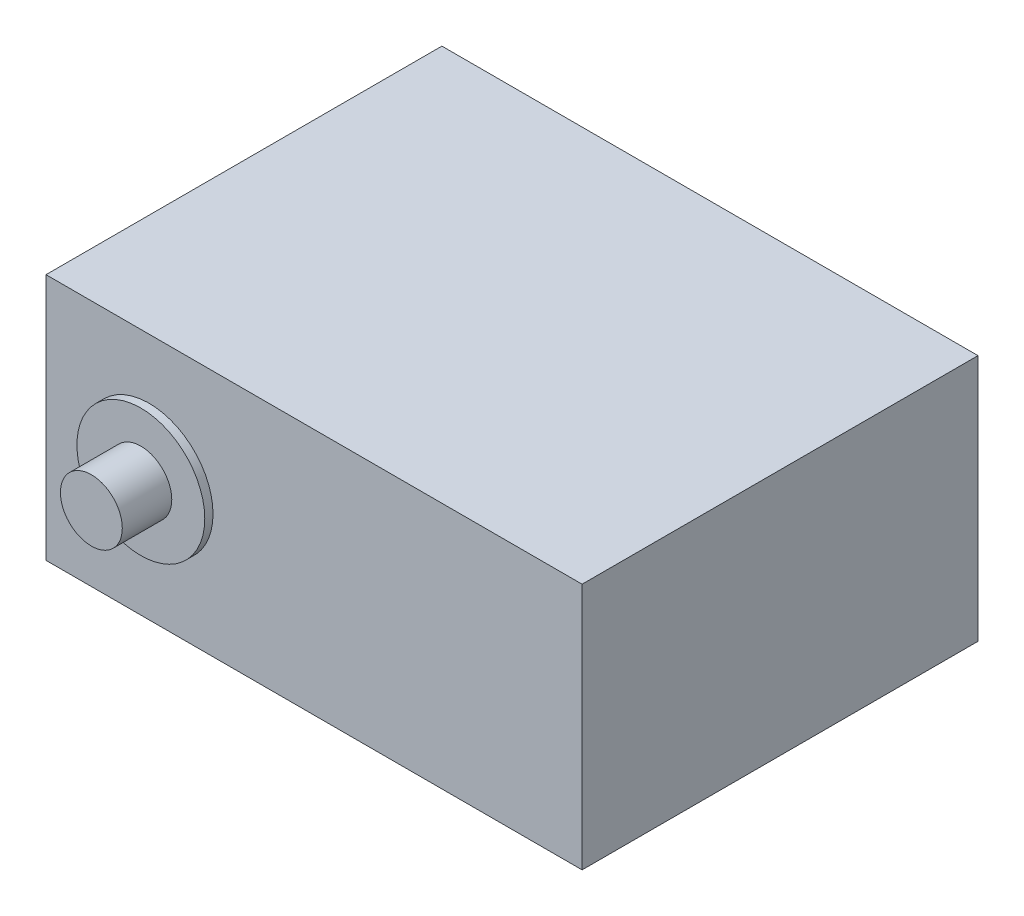
ISO-10303-21;
HEADER;
FILE_DESCRIPTION(('STEP AP214'),'2;1');
FILE_NAME('part.step','',(''),(''),'','','');
FILE_SCHEMA(('AUTOMOTIVE_DESIGN { 1 0 10303 214 1 1 1 1 }'));
ENDSEC;
DATA;
#1=APPLICATION_CONTEXT('core data for automotive mechanical design processes');
#2=APPLICATION_PROTOCOL_DEFINITION('international standard','automotive_design',2000,#1);
#3=PRODUCT_CONTEXT('',#1,'mechanical');
#4=PRODUCT('Part','Part','',(#3));
#5=PRODUCT_RELATED_PRODUCT_CATEGORY('part','',(#4));
#6=PRODUCT_DEFINITION_FORMATION('','',#4);
#7=PRODUCT_DEFINITION_CONTEXT('part definition',#1,'design');
#8=PRODUCT_DEFINITION('design','',#6,#7);
#9=PRODUCT_DEFINITION_SHAPE('','',#8);
#10=(LENGTH_UNIT() NAMED_UNIT(*) SI_UNIT(.MILLI.,.METRE.));
#11=(NAMED_UNIT(*) PLANE_ANGLE_UNIT() SI_UNIT($,.RADIAN.));
#12=(NAMED_UNIT(*) SI_UNIT($,.STERADIAN.) SOLID_ANGLE_UNIT());
#13=UNCERTAINTY_MEASURE_WITH_UNIT(LENGTH_MEASURE(1.E-05),#10,'distance_accuracy_value','');
#14=(GEOMETRIC_REPRESENTATION_CONTEXT(3) GLOBAL_UNCERTAINTY_ASSIGNED_CONTEXT((#13)) GLOBAL_UNIT_ASSIGNED_CONTEXT((#10,
#11,#12)) REPRESENTATION_CONTEXT('',''));
#15=CARTESIAN_POINT('',(0.,0.,0.));
#16=DIRECTION('',(0.,0.,1.));
#17=DIRECTION('',(1.,0.,0.));
#18=AXIS2_PLACEMENT_3D('',#15,#16,#17);
#19=CARTESIAN_POINT('',(-24.1428571428572,16.3571428571429,48.));
#20=DIRECTION('',(1.,0.,0.));
#21=DIRECTION('',(0.,0.,-1.));
#22=AXIS2_PLACEMENT_3D('',#19,#20,#21);
#23=PLANE('',#22);
#24=DIRECTION('',(0.,-1.,0.));
#25=VECTOR('',#24,1.);
#26=CARTESIAN_POINT('',(-24.1428571428572,16.3571428571429,0.));
#27=LINE('',#26,#25);
#28=CARTESIAN_POINT('',(-24.1428571428572,16.3571428571429,0.));
#29=VERTEX_POINT('',#28);
#30=CARTESIAN_POINT('',(-24.1428571428572,-13.6428571428571,0.));
#31=VERTEX_POINT('',#30);
#32=EDGE_CURVE('E180',#29,#31,#27,.T.);
#33=ORIENTED_EDGE('',*,*,#32,.T.);
#34=DIRECTION('',(0.,0.,-1.));
#35=VECTOR('',#34,1.);
#36=CARTESIAN_POINT('',(-24.1428571428572,-13.6428571428571,48.));
#37=LINE('',#36,#35);
#38=CARTESIAN_POINT('',(-24.1428571428572,-13.6428571428571,48.));
#39=VERTEX_POINT('',#38);
#40=EDGE_CURVE('E195',#39,#31,#37,.T.);
#41=ORIENTED_EDGE('',*,*,#40,.F.);
#42=DIRECTION('',(0.,-1.,0.));
#43=VECTOR('',#42,1.);
#44=CARTESIAN_POINT('',(-24.1428571428572,16.3571428571429,48.));
#45=LINE('',#44,#43);
#46=CARTESIAN_POINT('',(-24.1428571428572,16.3571428571429,48.));
#47=VERTEX_POINT('',#46);
#48=EDGE_CURVE('E166',#47,#39,#45,.T.);
#49=ORIENTED_EDGE('',*,*,#48,.F.);
#50=DIRECTION('',(0.,0.,-1.));
#51=VECTOR('',#50,1.);
#52=CARTESIAN_POINT('',(-24.1428571428572,16.3571428571429,48.));
#53=LINE('',#52,#51);
#54=EDGE_CURVE('E52',#47,#29,#53,.T.);
#55=ORIENTED_EDGE('',*,*,#54,.T.);
#56=EDGE_LOOP('',(#33,#41,#49,#55));
#57=FACE_BOUND('',#56,.T.);
#58=DIRECTION('',(0.,1.,0.));
#59=VECTOR('',#58,1.);
#60=CARTESIAN_POINT('',(-24.1428571428572,4.35714285714286,10.5));
#61=LINE('',#60,#59);
#62=CARTESIAN_POINT('',(-24.1428571428572,-1.64285714285714,10.5));
#63=VERTEX_POINT('',#62);
#64=CARTESIAN_POINT('',(-24.1428571428572,4.35714285714286,10.5));
#65=VERTEX_POINT('',#64);
#66=EDGE_CURVE('E131',#63,#65,#61,.T.);
#67=ORIENTED_EDGE('',*,*,#66,.F.);
#68=DIRECTION('',(0.,0.,1.));
#69=VECTOR('',#68,1.);
#70=CARTESIAN_POINT('',(-24.1428571428572,-1.64285714285714,6.5));
#71=LINE('',#70,#69);
#72=CARTESIAN_POINT('',(-24.1428571428572,-1.64285714285714,6.5));
#73=VERTEX_POINT('',#72);
#74=EDGE_CURVE('E128',#73,#63,#71,.T.);
#75=ORIENTED_EDGE('',*,*,#74,.F.);
#76=DIRECTION('',(0.,-1.,0.));
#77=VECTOR('',#76,1.);
#78=CARTESIAN_POINT('',(-24.1428571428572,4.35714285714286,6.5));
#79=LINE('',#78,#77);
#80=CARTESIAN_POINT('',(-24.1428571428572,4.35714285714286,6.5));
#81=VERTEX_POINT('',#80);
#82=EDGE_CURVE('E64',#81,#73,#79,.T.);
#83=ORIENTED_EDGE('',*,*,#82,.F.);
#84=DIRECTION('',(0.,0.,-1.));
#85=VECTOR('',#84,1.);
#86=CARTESIAN_POINT('',(-24.1428571428572,4.35714285714286,6.5));
#87=LINE('',#86,#85);
#88=EDGE_CURVE('E59',#65,#81,#87,.T.);
#89=ORIENTED_EDGE('',*,*,#88,.F.);
#90=EDGE_LOOP('',(#67,#75,#83,#89));
#91=FACE_BOUND('',#90,.T.);
#92=ADVANCED_FACE('F43',(#57,#91),#23,.F.);
#93=CARTESIAN_POINT('',(-24.1428571428572,16.3571428571429,48.));
#94=DIRECTION('',(0.,-1.,0.));
#95=DIRECTION('',(0.,0.,-1.));
#96=AXIS2_PLACEMENT_3D('',#93,#94,#95);
#97=PLANE('',#96);
#98=DIRECTION('',(-1.,0.,0.));
#99=VECTOR('',#98,1.);
#100=CARTESIAN_POINT('',(-24.1428571428572,16.3571428571429,0.));
#101=LINE('',#100,#99);
#102=CARTESIAN_POINT('',(40.8571428571428,16.3571428571429,0.));
#103=VERTEX_POINT('',#102);
#104=EDGE_CURVE('E161',#103,#29,#101,.T.);
#105=ORIENTED_EDGE('',*,*,#104,.T.);
#106=ORIENTED_EDGE('',*,*,#54,.F.);
#107=DIRECTION('',(-1.,0.,0.));
#108=VECTOR('',#107,1.);
#109=CARTESIAN_POINT('',(-24.1428571428572,16.3571428571429,48.));
#110=LINE('',#109,#108);
#111=CARTESIAN_POINT('',(40.8571428571428,16.3571428571429,48.));
#112=VERTEX_POINT('',#111);
#113=EDGE_CURVE('E162',#112,#47,#110,.T.);
#114=ORIENTED_EDGE('',*,*,#113,.F.);
#115=DIRECTION('',(0.,0.,-1.));
#116=VECTOR('',#115,1.);
#117=CARTESIAN_POINT('',(40.8571428571428,16.3571428571429,48.));
#118=LINE('',#117,#116);
#119=EDGE_CURVE('E176',#112,#103,#118,.T.);
#120=ORIENTED_EDGE('',*,*,#119,.T.);
#121=EDGE_LOOP('',(#105,#106,#114,#120));
#122=FACE_BOUND('',#121,.T.);
#123=ADVANCED_FACE('F45',(#122),#97,.F.);
#124=CARTESIAN_POINT('',(-24.1428571428572,-13.6428571428571,48.));
#125=DIRECTION('',(0.,1.,0.));
#126=DIRECTION('',(0.,0.,1.));
#127=AXIS2_PLACEMENT_3D('',#124,#125,#126);
#128=PLANE('',#127);
#129=DIRECTION('',(1.,0.,0.));
#130=VECTOR('',#129,1.);
#131=CARTESIAN_POINT('',(-24.1428571428572,-13.6428571428571,0.));
#132=LINE('',#131,#130);
#133=CARTESIAN_POINT('',(40.8571428571428,-13.6428571428571,0.));
#134=VERTEX_POINT('',#133);
#135=EDGE_CURVE('E183',#31,#134,#132,.T.);
#136=ORIENTED_EDGE('',*,*,#135,.T.);
#137=DIRECTION('',(0.,0.,-1.));
#138=VECTOR('',#137,1.);
#139=CARTESIAN_POINT('',(40.8571428571428,-13.6428571428571,48.));
#140=LINE('',#139,#138);
#141=CARTESIAN_POINT('',(40.8571428571428,-13.6428571428571,48.));
#142=VERTEX_POINT('',#141);
#143=EDGE_CURVE('E191',#142,#134,#140,.T.);
#144=ORIENTED_EDGE('',*,*,#143,.F.);
#145=DIRECTION('',(1.,0.,0.));
#146=VECTOR('',#145,1.);
#147=CARTESIAN_POINT('',(-24.1428571428572,-13.6428571428571,48.));
#148=LINE('',#147,#146);
#149=EDGE_CURVE('E170',#39,#142,#148,.T.);
#150=ORIENTED_EDGE('',*,*,#149,.F.);
#151=ORIENTED_EDGE('',*,*,#40,.T.);
#152=EDGE_LOOP('',(#136,#144,#150,#151));
#153=FACE_BOUND('',#152,.T.);
#154=ADVANCED_FACE('F244',(#153),#128,.F.);
#155=CARTESIAN_POINT('',(40.8571428571428,-13.6428571428571,48.));
#156=DIRECTION('',(-1.,0.,0.));
#157=DIRECTION('',(0.,0.,1.));
#158=AXIS2_PLACEMENT_3D('',#155,#156,#157);
#159=PLANE('',#158);
#160=DIRECTION('',(0.,1.,0.));
#161=VECTOR('',#160,1.);
#162=CARTESIAN_POINT('',(40.8571428571428,-13.6428571428571,0.));
#163=LINE('',#162,#161);
#164=EDGE_CURVE('E167',#134,#103,#163,.T.);
#165=ORIENTED_EDGE('',*,*,#164,.T.);
#166=ORIENTED_EDGE('',*,*,#119,.F.);
#167=DIRECTION('',(0.,1.,0.));
#168=VECTOR('',#167,1.);
#169=CARTESIAN_POINT('',(40.8571428571428,-13.6428571428571,48.));
#170=LINE('',#169,#168);
#171=EDGE_CURVE('E173',#142,#112,#170,.T.);
#172=ORIENTED_EDGE('',*,*,#171,.F.);
#173=ORIENTED_EDGE('',*,*,#143,.T.);
#174=EDGE_LOOP('',(#165,#166,#172,#173));
#175=FACE_BOUND('',#174,.T.);
#176=ADVANCED_FACE('F240',(#175),#159,.F.);
#177=CARTESIAN_POINT('',(0.,0.,48.));
#178=DIRECTION('',(0.,0.,1.));
#179=DIRECTION('',(1.,0.,0.));
#180=AXIS2_PLACEMENT_3D('',#177,#178,#179);
#181=PLANE('',#180);
#182=CARTESIAN_POINT('',(-11.6428571428572,1.35714285714286,48.));
#183=DIRECTION('',(0.,0.,1.));
#184=DIRECTION('',(1.,0.,0.));
#185=AXIS2_PLACEMENT_3D('',#182,#183,#184);
#186=CIRCLE('',#185,7.75);
#187=CARTESIAN_POINT('',(-3.89285714285716,1.35714285714286,48.));
#188=VERTEX_POINT('',#187);
#189=EDGE_CURVE('E148',#188,#188,#186,.T.);
#190=ORIENTED_EDGE('',*,*,#189,.F.);
#191=EDGE_LOOP('',(#190));
#192=FACE_BOUND('',#191,.T.);
#193=ORIENTED_EDGE('',*,*,#113,.T.);
#194=ORIENTED_EDGE('',*,*,#48,.T.);
#195=ORIENTED_EDGE('',*,*,#149,.T.);
#196=ORIENTED_EDGE('',*,*,#171,.T.);
#197=EDGE_LOOP('',(#193,#194,#195,#196));
#198=FACE_BOUND('',#197,.T.);
#199=ADVANCED_FACE('F229',(#192,#198),#181,.T.);
#200=CARTESIAN_POINT('',(0.,0.,0.));
#201=DIRECTION('',(0.,0.,1.));
#202=DIRECTION('',(1.,0.,0.));
#203=AXIS2_PLACEMENT_3D('',#200,#201,#202);
#204=PLANE('',#203);
#205=CARTESIAN_POINT('',(-11.6428571428572,1.35714285714286,0.));
#206=DIRECTION('',(0.,0.,1.));
#207=DIRECTION('',(1.,0.,0.));
#208=AXIS2_PLACEMENT_3D('',#205,#206,#207);
#209=CIRCLE('',#208,7.75);
#210=CARTESIAN_POINT('',(-3.89285714285715,1.35714285714286,0.));
#211=VERTEX_POINT('',#210);
#212=EDGE_CURVE('E11',#211,#211,#209,.F.);
#213=ORIENTED_EDGE('',*,*,#212,.F.);
#214=EDGE_LOOP('',(#213));
#215=FACE_BOUND('',#214,.T.);
#216=ORIENTED_EDGE('',*,*,#104,.F.);
#217=ORIENTED_EDGE('',*,*,#164,.F.);
#218=ORIENTED_EDGE('',*,*,#135,.F.);
#219=ORIENTED_EDGE('',*,*,#32,.F.);
#220=EDGE_LOOP('',(#216,#217,#218,#219));
#221=FACE_BOUND('',#220,.T.);
#222=ADVANCED_FACE('F225',(#215,#221),#204,.F.);
#223=CARTESIAN_POINT('',(-11.6428571428572,1.35714285714286,49.));
#224=DIRECTION('',(0.,0.,-1.));
#225=DIRECTION('',(-1.,0.,0.));
#226=AXIS2_PLACEMENT_3D('',#223,#224,#225);
#227=CYLINDRICAL_SURFACE('',#226,7.75);
#228=CARTESIAN_POINT('',(-11.6428571428572,1.35714285714286,49.));
#229=DIRECTION('',(0.,0.,1.));
#230=DIRECTION('',(1.,0.,0.));
#231=AXIS2_PLACEMENT_3D('',#228,#229,#230);
#232=CIRCLE('',#231,7.75);
#233=CARTESIAN_POINT('',(-3.89285714285716,1.35714285714286,49.));
#234=VERTEX_POINT('',#233);
#235=EDGE_CURVE('E149',#234,#234,#232,.T.);
#236=ORIENTED_EDGE('',*,*,#235,.F.);
#237=EDGE_LOOP('',(#236));
#238=FACE_BOUND('',#237,.T.);
#239=ORIENTED_EDGE('',*,*,#189,.T.);
#240=EDGE_LOOP('',(#239));
#241=FACE_BOUND('',#240,.T.);
#242=ADVANCED_FACE('F228',(#238,#241),#227,.T.);
#243=CARTESIAN_POINT('',(-11.6428571428572,1.35714285714286,49.));
#244=DIRECTION('',(0.,0.,1.));
#245=DIRECTION('',(1.,0.,0.));
#246=AXIS2_PLACEMENT_3D('',#243,#244,#245);
#247=PLANE('',#246);
#248=CARTESIAN_POINT('',(-11.6428571428572,1.35714285714286,49.));
#249=DIRECTION('',(0.,0.,1.));
#250=DIRECTION('',(1.,0.,0.));
#251=AXIS2_PLACEMENT_3D('',#248,#249,#250);
#252=CIRCLE('',#251,3.75);
#253=CARTESIAN_POINT('',(-7.89285714285716,1.35714285714286,49.));
#254=VERTEX_POINT('',#253);
#255=EDGE_CURVE('E153',#254,#254,#252,.T.);
#256=ORIENTED_EDGE('',*,*,#255,.F.);
#257=EDGE_LOOP('',(#256));
#258=FACE_BOUND('',#257,.T.);
#259=ORIENTED_EDGE('',*,*,#235,.T.);
#260=EDGE_LOOP('',(#259));
#261=FACE_BOUND('',#260,.T.);
#262=ADVANCED_FACE('F282',(#258,#261),#247,.T.);
#263=CARTESIAN_POINT('',(-11.6428571428572,1.35714285714286,55.));
#264=DIRECTION('',(0.,0.,1.));
#265=DIRECTION('',(1.,0.,0.));
#266=AXIS2_PLACEMENT_3D('',#263,#264,#265);
#267=PLANE('',#266);
#268=CARTESIAN_POINT('',(-11.6428571428572,1.35714285714286,55.));
#269=DIRECTION('',(0.,0.,1.));
#270=DIRECTION('',(1.,0.,0.));
#271=AXIS2_PLACEMENT_3D('',#268,#269,#270);
#272=CIRCLE('',#271,3.75);
#273=CARTESIAN_POINT('',(-7.89285714285716,1.35714285714286,55.));
#274=VERTEX_POINT('',#273);
#275=EDGE_CURVE('E157',#274,#274,#272,.T.);
#276=ORIENTED_EDGE('',*,*,#275,.T.);
#277=EDGE_LOOP('',(#276));
#278=FACE_BOUND('',#277,.T.);
#279=ADVANCED_FACE('F278',(#278),#267,.T.);
#280=CARTESIAN_POINT('',(-11.6428571428572,1.35714285714286,55.));
#281=DIRECTION('',(0.,0.,-1.));
#282=DIRECTION('',(-1.,0.,0.));
#283=AXIS2_PLACEMENT_3D('',#280,#281,#282);
#284=CYLINDRICAL_SURFACE('',#283,3.75);
#285=ORIENTED_EDGE('',*,*,#255,.T.);
#286=EDGE_LOOP('',(#285));
#287=FACE_BOUND('',#286,.T.);
#288=ORIENTED_EDGE('',*,*,#275,.F.);
#289=EDGE_LOOP('',(#288));
#290=FACE_BOUND('',#289,.T.);
#291=ADVANCED_FACE('F221',(#287,#290),#284,.T.);
#292=CARTESIAN_POINT('',(-11.6428571428572,1.35714285714286,-1.));
#293=DIRECTION('',(0.,0.,1.));
#294=DIRECTION('',(1.,0.,0.));
#295=AXIS2_PLACEMENT_3D('',#292,#293,#294);
#296=CYLINDRICAL_SURFACE('',#295,7.75);
#297=CARTESIAN_POINT('',(-11.6428571428572,1.35714285714286,-1.));
#298=DIRECTION('',(0.,0.,-1.));
#299=DIRECTION('',(-1.,0.,0.));
#300=AXIS2_PLACEMENT_3D('',#297,#298,#299);
#301=CIRCLE('',#300,7.75);
#302=CARTESIAN_POINT('',(-19.3928571428572,1.35714285714286,-1.));
#303=VERTEX_POINT('',#302);
#304=EDGE_CURVE('E133',#303,#303,#301,.T.);
#305=ORIENTED_EDGE('',*,*,#304,.F.);
#306=EDGE_LOOP('',(#305));
#307=FACE_BOUND('',#306,.T.);
#308=ORIENTED_EDGE('',*,*,#212,.T.);
#309=EDGE_LOOP('',(#308));
#310=FACE_BOUND('',#309,.T.);
#311=ADVANCED_FACE('F215',(#307,#310),#296,.T.);
#312=CARTESIAN_POINT('',(-11.6428571428572,1.35714285714286,-1.));
#313=DIRECTION('',(0.,0.,-1.));
#314=DIRECTION('',(-1.,0.,0.));
#315=AXIS2_PLACEMENT_3D('',#312,#313,#314);
#316=PLANE('',#315);
#317=CARTESIAN_POINT('',(-11.6428571428572,1.35714285714286,-1.));
#318=DIRECTION('',(0.,0.,-1.));
#319=DIRECTION('',(-1.,0.,0.));
#320=AXIS2_PLACEMENT_3D('',#317,#318,#319);
#321=CIRCLE('',#320,3.);
#322=CARTESIAN_POINT('',(-14.6428571428571,1.35714285714286,-1.));
#323=VERTEX_POINT('',#322);
#324=EDGE_CURVE('E138',#323,#323,#321,.T.);
#325=ORIENTED_EDGE('',*,*,#324,.F.);
#326=EDGE_LOOP('',(#325));
#327=FACE_BOUND('',#326,.T.);
#328=ORIENTED_EDGE('',*,*,#304,.T.);
#329=EDGE_LOOP('',(#328));
#330=FACE_BOUND('',#329,.T.);
#331=ADVANCED_FACE('F211',(#327,#330),#316,.T.);
#332=CARTESIAN_POINT('',(-11.6428571428572,1.35714285714286,-7.));
#333=DIRECTION('',(0.,0.,-1.));
#334=DIRECTION('',(-1.,0.,0.));
#335=AXIS2_PLACEMENT_3D('',#332,#333,#334);
#336=PLANE('',#335);
#337=CARTESIAN_POINT('',(-11.6428571428572,1.35714285714286,-7.));
#338=DIRECTION('',(0.,0.,-1.));
#339=DIRECTION('',(-1.,0.,0.));
#340=AXIS2_PLACEMENT_3D('',#337,#338,#339);
#341=CIRCLE('',#340,3.);
#342=CARTESIAN_POINT('',(-14.6428571428571,1.35714285714286,-7.));
#343=VERTEX_POINT('',#342);
#344=EDGE_CURVE('E144',#343,#343,#341,.T.);
#345=ORIENTED_EDGE('',*,*,#344,.T.);
#346=EDGE_LOOP('',(#345));
#347=FACE_BOUND('',#346,.T.);
#348=ADVANCED_FACE('F214',(#347),#336,.T.);
#349=CARTESIAN_POINT('',(-11.6428571428572,1.35714285714286,-7.));
#350=DIRECTION('',(0.,0.,1.));
#351=DIRECTION('',(1.,0.,0.));
#352=AXIS2_PLACEMENT_3D('',#349,#350,#351);
#353=CYLINDRICAL_SURFACE('',#352,3.);
#354=ORIENTED_EDGE('',*,*,#324,.T.);
#355=EDGE_LOOP('',(#354));
#356=FACE_BOUND('',#355,.T.);
#357=ORIENTED_EDGE('',*,*,#344,.F.);
#358=EDGE_LOOP('',(#357));
#359=FACE_BOUND('',#358,.T.);
#360=ADVANCED_FACE('F208',(#356,#359),#353,.T.);
#361=CARTESIAN_POINT('',(-29.6428571428572,4.35714285714286,10.5));
#362=DIRECTION('',(0.,0.,-1.));
#363=DIRECTION('',(0.,1.,0.));
#364=AXIS2_PLACEMENT_3D('',#361,#362,#363);
#365=PLANE('',#364);
#366=ORIENTED_EDGE('',*,*,#66,.T.);
#367=DIRECTION('',(1.,0.,0.));
#368=VECTOR('',#367,1.);
#369=CARTESIAN_POINT('',(-29.6428571428572,4.35714285714286,10.5));
#370=LINE('',#369,#368);
#371=CARTESIAN_POINT('',(-29.6428571428572,4.35714285714286,10.5));
#372=VERTEX_POINT('',#371);
#373=EDGE_CURVE('E110',#372,#65,#370,.T.);
#374=ORIENTED_EDGE('',*,*,#373,.F.);
#375=DIRECTION('',(0.,1.,0.));
#376=VECTOR('',#375,1.);
#377=CARTESIAN_POINT('',(-29.6428571428572,4.35714285714286,10.5));
#378=LINE('',#377,#376);
#379=CARTESIAN_POINT('',(-29.6428571428572,-1.64285714285714,10.5));
#380=VERTEX_POINT('',#379);
#381=EDGE_CURVE('E118',#380,#372,#378,.T.);
#382=ORIENTED_EDGE('',*,*,#381,.F.);
#383=DIRECTION('',(1.,0.,0.));
#384=VECTOR('',#383,1.);
#385=CARTESIAN_POINT('',(-29.6428571428572,-1.64285714285714,10.5));
#386=LINE('',#385,#384);
#387=EDGE_CURVE('E422',#380,#63,#386,.T.);
#388=ORIENTED_EDGE('',*,*,#387,.T.);
#389=EDGE_LOOP('',(#366,#374,#382,#388));
#390=FACE_BOUND('',#389,.T.);
#391=ADVANCED_FACE('F130',(#390),#365,.F.);
#392=CARTESIAN_POINT('',(-29.6428571428572,4.35714285714286,6.5));
#393=DIRECTION('',(0.,-1.,0.));
#394=DIRECTION('',(0.,0.,-1.));
#395=AXIS2_PLACEMENT_3D('',#392,#393,#394);
#396=PLANE('',#395);
#397=ORIENTED_EDGE('',*,*,#88,.T.);
#398=DIRECTION('',(1.,0.,0.));
#399=VECTOR('',#398,1.);
#400=CARTESIAN_POINT('',(-29.6428571428572,4.35714285714286,6.5));
#401=LINE('',#400,#399);
#402=CARTESIAN_POINT('',(-29.6428571428572,4.35714285714286,6.5));
#403=VERTEX_POINT('',#402);
#404=EDGE_CURVE('E113',#403,#81,#401,.T.);
#405=ORIENTED_EDGE('',*,*,#404,.F.);
#406=DIRECTION('',(0.,0.,-1.));
#407=VECTOR('',#406,1.);
#408=CARTESIAN_POINT('',(-29.6428571428572,4.35714285714286,6.5));
#409=LINE('',#408,#407);
#410=EDGE_CURVE('E106',#372,#403,#409,.T.);
#411=ORIENTED_EDGE('',*,*,#410,.F.);
#412=ORIENTED_EDGE('',*,*,#373,.T.);
#413=EDGE_LOOP('',(#397,#405,#411,#412));
#414=FACE_BOUND('',#413,.T.);
#415=ADVANCED_FACE('F108',(#414),#396,.F.);
#416=CARTESIAN_POINT('',(-29.6428571428572,4.35714285714286,6.5));
#417=DIRECTION('',(0.,0.,1.));
#418=DIRECTION('',(0.,-1.,0.));
#419=AXIS2_PLACEMENT_3D('',#416,#417,#418);
#420=PLANE('',#419);
#421=ORIENTED_EDGE('',*,*,#82,.T.);
#422=DIRECTION('',(1.,0.,0.));
#423=VECTOR('',#422,1.);
#424=CARTESIAN_POINT('',(-29.6428571428572,-1.64285714285714,6.5));
#425=LINE('',#424,#423);
#426=CARTESIAN_POINT('',(-29.6428571428572,-1.64285714285714,6.5));
#427=VERTEX_POINT('',#426);
#428=EDGE_CURVE('E140',#427,#73,#425,.T.);
#429=ORIENTED_EDGE('',*,*,#428,.F.);
#430=DIRECTION('',(0.,-1.,0.));
#431=VECTOR('',#430,1.);
#432=CARTESIAN_POINT('',(-29.6428571428572,4.35714285714286,6.5));
#433=LINE('',#432,#431);
#434=EDGE_CURVE('E117',#403,#427,#433,.T.);
#435=ORIENTED_EDGE('',*,*,#434,.F.);
#436=ORIENTED_EDGE('',*,*,#404,.T.);
#437=EDGE_LOOP('',(#421,#429,#435,#436));
#438=FACE_BOUND('',#437,.T.);
#439=ADVANCED_FACE('F380',(#438),#420,.F.);
#440=CARTESIAN_POINT('',(-29.6428571428572,-1.64285714285714,6.5));
#441=DIRECTION('',(0.,1.,0.));
#442=DIRECTION('',(0.,0.,1.));
#443=AXIS2_PLACEMENT_3D('',#440,#441,#442);
#444=PLANE('',#443);
#445=ORIENTED_EDGE('',*,*,#74,.T.);
#446=ORIENTED_EDGE('',*,*,#387,.F.);
#447=DIRECTION('',(0.,0.,1.));
#448=VECTOR('',#447,1.);
#449=CARTESIAN_POINT('',(-29.6428571428572,-1.64285714285714,6.5));
#450=LINE('',#449,#448);
#451=EDGE_CURVE('E123',#427,#380,#450,.T.);
#452=ORIENTED_EDGE('',*,*,#451,.F.);
#453=ORIENTED_EDGE('',*,*,#428,.T.);
#454=EDGE_LOOP('',(#445,#446,#452,#453));
#455=FACE_BOUND('',#454,.T.);
#456=ADVANCED_FACE('F390',(#455),#444,.F.);
#457=CARTESIAN_POINT('',(-29.6428571428572,0.,0.));
#458=DIRECTION('',(-1.,0.,0.));
#459=DIRECTION('',(0.,0.,1.));
#460=AXIS2_PLACEMENT_3D('',#457,#458,#459);
#461=PLANE('',#460);
#462=ORIENTED_EDGE('',*,*,#381,.T.);
#463=ORIENTED_EDGE('',*,*,#410,.T.);
#464=ORIENTED_EDGE('',*,*,#434,.T.);
#465=ORIENTED_EDGE('',*,*,#451,.T.);
#466=EDGE_LOOP('',(#462,#463,#464,#465));
#467=FACE_BOUND('',#466,.T.);
#468=ADVANCED_FACE('F121',(#467),#461,.T.);
#469=CLOSED_SHELL('',(#92,#123,#154,#176,#199,#222,#242,#262,#279,#291,#311,#331,#348,#360,#391,
#415,#439,#456,#468));
#470=MANIFOLD_SOLID_BREP('B2',#469);
#471=ADVANCED_BREP_SHAPE_REPRESENTATION('',(#18,#470),#14);
#472=SHAPE_DEFINITION_REPRESENTATION(#9,#471);
ENDSEC;
END-ISO-10303-21;
